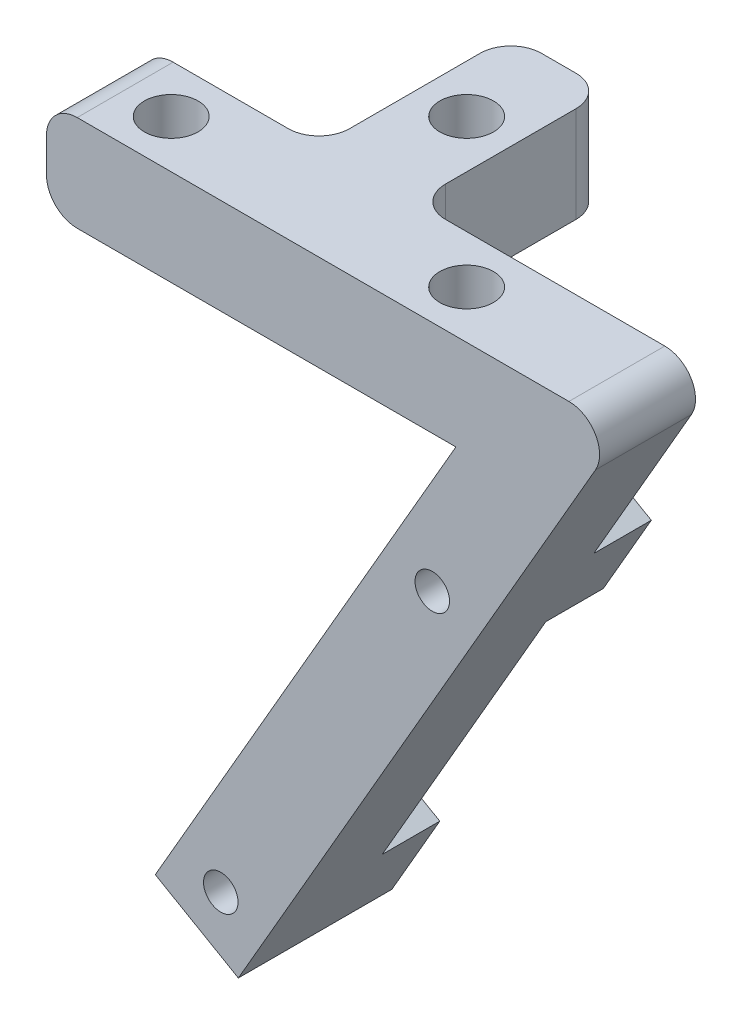
ISO-10303-21;
HEADER;
FILE_DESCRIPTION(('STEP AP214'),'2;1');
FILE_NAME('part.step','',(''),(''),'','','');
FILE_SCHEMA(('AUTOMOTIVE_DESIGN { 1 0 10303 214 1 1 1 1 }'));
ENDSEC;
DATA;
#1=APPLICATION_CONTEXT('core data for automotive mechanical design processes');
#2=APPLICATION_PROTOCOL_DEFINITION('international standard','automotive_design',2000,#1);
#3=PRODUCT_CONTEXT('',#1,'mechanical');
#4=PRODUCT('Part','Part','',(#3));
#5=PRODUCT_RELATED_PRODUCT_CATEGORY('part','',(#4));
#6=PRODUCT_DEFINITION_FORMATION('','',#4);
#7=PRODUCT_DEFINITION_CONTEXT('part definition',#1,'design');
#8=PRODUCT_DEFINITION('design','',#6,#7);
#9=PRODUCT_DEFINITION_SHAPE('','',#8);
#10=(LENGTH_UNIT() NAMED_UNIT(*) SI_UNIT(.MILLI.,.METRE.));
#11=(NAMED_UNIT(*) PLANE_ANGLE_UNIT() SI_UNIT($,.RADIAN.));
#12=(NAMED_UNIT(*) SI_UNIT($,.STERADIAN.) SOLID_ANGLE_UNIT());
#13=UNCERTAINTY_MEASURE_WITH_UNIT(LENGTH_MEASURE(1.E-05),#10,'distance_accuracy_value','');
#14=(GEOMETRIC_REPRESENTATION_CONTEXT(3) GLOBAL_UNCERTAINTY_ASSIGNED_CONTEXT((#13)) GLOBAL_UNIT_ASSIGNED_CONTEXT((#10,
#11,#12)) REPRESENTATION_CONTEXT('',''));
#15=CARTESIAN_POINT('',(0.,0.,0.));
#16=DIRECTION('',(0.,0.,1.));
#17=DIRECTION('',(1.,0.,0.));
#18=AXIS2_PLACEMENT_3D('',#15,#16,#17);
#19=CARTESIAN_POINT('',(0.,0.,0.));
#20=DIRECTION('',(0.,0.,-1.));
#21=DIRECTION('',(-1.,0.,0.));
#22=AXIS2_PLACEMENT_3D('',#19,#20,#21);
#23=PLANE('',#22);
#24=DIRECTION('',(0.500000000000004,0.866025403784436,0.));
#25=VECTOR('',#24,1.);
#26=CARTESIAN_POINT('',(38.1,0.,0.));
#27=LINE('',#26,#25);
#28=CARTESIAN_POINT('',(15.8749999999998,-38.4948291982182,0.));
#29=VERTEX_POINT('',#28);
#30=CARTESIAN_POINT('',(26.6999719999998,-19.7454277037077,0.));
#31=VERTEX_POINT('',#30);
#32=EDGE_CURVE('E314',#29,#31,#27,.T.);
#33=ORIENTED_EDGE('',*,*,#32,.F.);
#34=DIRECTION('',(0.866025403784438,-0.500000000000001,0.));
#35=VECTOR('',#34,1.);
#36=CARTESIAN_POINT('',(15.8749999999998,-38.4948291982182,0.));
#37=LINE('',#36,#35);
#38=CARTESIAN_POINT('',(10.3757386859688,-35.3198291982183,0.));
#39=VERTEX_POINT('',#38);
#40=EDGE_CURVE('E215',#39,#29,#37,.T.);
#41=ORIENTED_EDGE('',*,*,#40,.F.);
#42=DIRECTION('',(-0.500000000000004,-0.866025403784436,0.));
#43=VECTOR('',#42,1.);
#44=CARTESIAN_POINT('',(7.20073868596865,-40.8190905122493,0.));
#45=LINE('',#44,#43);
#46=CARTESIAN_POINT('',(21.2007106859688,-16.5704277037078,0.));
#47=VERTEX_POINT('',#46);
#48=EDGE_CURVE('E313',#47,#39,#45,.T.);
#49=ORIENTED_EDGE('',*,*,#48,.F.);
#50=DIRECTION('',(-0.866025403784438,0.500000000000001,0.));
#51=VECTOR('',#50,1.);
#52=CARTESIAN_POINT('',(21.2007106859688,-16.5704277037078,0.));
#53=LINE('',#52,#51);
#54=EDGE_CURVE('E226',#31,#47,#53,.T.);
#55=ORIENTED_EDGE('',*,*,#54,.F.);
#56=EDGE_LOOP('',(#33,#41,#49,#55));
#57=FACE_BOUND('',#56,.T.);
#58=ADVANCED_FACE('F33',(#57),#23,.T.);
#59=DIRECTION('',(1.,0.,0.));
#60=VECTOR('',#59,1.);
#61=CARTESIAN_POINT('',(27.1014773719376,-6.34999999999999,0.));
#62=LINE('',#61,#60);
#63=CARTESIAN_POINT('',(20.066,-6.35,0.));
#64=VERTEX_POINT('',#63);
#65=CARTESIAN_POINT('',(27.1014773719376,-6.34999999999999,0.));
#66=VERTEX_POINT('',#65);
#67=EDGE_CURVE('E306',#64,#66,#62,.T.);
#68=ORIENTED_EDGE('',*,*,#67,.F.);
#69=DIRECTION('',(0.,1.,0.));
#70=VECTOR('',#69,1.);
#71=CARTESIAN_POINT('',(20.066,0.,0.));
#72=LINE('',#71,#70);
#73=CARTESIAN_POINT('',(20.066,0.,0.));
#74=VERTEX_POINT('',#73);
#75=EDGE_CURVE('E356',#64,#74,#72,.T.);
#76=ORIENTED_EDGE('',*,*,#75,.T.);
#77=DIRECTION('',(-1.,0.,0.));
#78=VECTOR('',#77,1.);
#79=CARTESIAN_POINT('',(0.,0.,0.));
#80=LINE('',#79,#78);
#81=CARTESIAN_POINT('',(34.58047275902,0.,0.));
#82=VERTEX_POINT('',#81);
#83=EDGE_CURVE('E296',#82,#74,#80,.T.);
#84=ORIENTED_EDGE('',*,*,#83,.F.);
#85=CARTESIAN_POINT('',(34.58047275902,-2.032,0.));
#86=DIRECTION('',(0.,0.,-1.));
#87=DIRECTION('',(-1.,0.,0.));
#88=AXIS2_PLACEMENT_3D('',#85,#86,#87);
#89=CIRCLE('',#88,2.032);
#90=CARTESIAN_POINT('',(36.34023637951,-3.04800000000001,0.));
#91=VERTEX_POINT('',#90);
#92=EDGE_CURVE('E354',#82,#91,#89,.T.);
#93=ORIENTED_EDGE('',*,*,#92,.T.);
#94=CARTESIAN_POINT('',(29.8749719999998,-14.2461663896768,0.));
#95=VERTEX_POINT('',#94);
#96=EDGE_CURVE('E312',#95,#91,#27,.T.);
#97=ORIENTED_EDGE('',*,*,#96,.F.);
#98=DIRECTION('',(0.866025403784439,-0.5,0.));
#99=VECTOR('',#98,1.);
#100=CARTESIAN_POINT('',(29.8749719999998,-14.2461663896765,0.));
#101=LINE('',#100,#99);
#102=CARTESIAN_POINT('',(24.3757106859688,-11.0711663896766,0.));
#103=VERTEX_POINT('',#102);
#104=EDGE_CURVE('E231',#103,#95,#101,.T.);
#105=ORIENTED_EDGE('',*,*,#104,.F.);
#106=EDGE_CURVE('E309',#66,#103,#45,.T.);
#107=ORIENTED_EDGE('',*,*,#106,.F.);
#108=EDGE_LOOP('',(#68,#76,#84,#93,#97,#105,#107));
#109=FACE_BOUND('',#108,.T.);
#110=ADVANCED_FACE('F407',(#109),#23,.T.);
#111=CARTESIAN_POINT('',(0.,-6.35,6.35));
#112=DIRECTION('',(1.,0.,0.));
#113=DIRECTION('',(0.,0.,-1.));
#114=AXIS2_PLACEMENT_3D('',#111,#112,#113);
#115=PLANE('',#114);
#116=DIRECTION('',(0.,-1.,0.));
#117=VECTOR('',#116,1.);
#118=CARTESIAN_POINT('',(0.,-6.35,6.35));
#119=LINE('',#118,#117);
#120=CARTESIAN_POINT('',(0.,-2.032,6.35));
#121=VERTEX_POINT('',#120);
#122=CARTESIAN_POINT('',(0.,-4.318,6.35));
#123=VERTEX_POINT('',#122);
#124=EDGE_CURVE('E293',#121,#123,#119,.T.);
#125=ORIENTED_EDGE('',*,*,#124,.F.);
#126=DIRECTION('',(0.,0.,-1.));
#127=VECTOR('',#126,1.);
#128=CARTESIAN_POINT('',(0.,-2.032,6.35));
#129=LINE('',#128,#127);
#130=CARTESIAN_POINT('',(0.,-2.032,0.));
#131=VERTEX_POINT('',#130);
#132=EDGE_CURVE('E366',#121,#131,#129,.T.);
#133=ORIENTED_EDGE('',*,*,#132,.T.);
#134=DIRECTION('',(0.,-1.,0.));
#135=VECTOR('',#134,1.);
#136=CARTESIAN_POINT('',(0.,-6.35,0.));
#137=LINE('',#136,#135);
#138=CARTESIAN_POINT('',(0.,-4.318,0.));
#139=VERTEX_POINT('',#138);
#140=EDGE_CURVE('E284',#131,#139,#137,.T.);
#141=ORIENTED_EDGE('',*,*,#140,.T.);
#142=DIRECTION('',(0.,0.,-1.));
#143=VECTOR('',#142,1.);
#144=CARTESIAN_POINT('',(0.,-4.318,6.35));
#145=LINE('',#144,#143);
#146=EDGE_CURVE('E58',#139,#123,#145,.F.);
#147=ORIENTED_EDGE('',*,*,#146,.T.);
#148=EDGE_LOOP('',(#125,#133,#141,#147));
#149=FACE_BOUND('',#148,.T.);
#150=ADVANCED_FACE('F414',(#149),#115,.F.);
#151=CARTESIAN_POINT('',(27.1014773719376,-6.34999999999999,6.35));
#152=DIRECTION('',(0.,1.,0.));
#153=DIRECTION('',(-1.,0.,0.));
#154=AXIS2_PLACEMENT_3D('',#151,#152,#153);
#155=PLANE('',#154);
#156=CARTESIAN_POINT('',(14.859,-6.35,-6.604));
#157=DIRECTION('',(0.,1.,0.));
#158=DIRECTION('',(0.,0.,1.));
#159=AXIS2_PLACEMENT_3D('',#156,#157,#158);
#160=CIRCLE('',#159,1.778);
#161=CARTESIAN_POINT('',(14.859,-6.35,-4.826));
#162=VERTEX_POINT('',#161);
#163=EDGE_CURVE('E257',#162,#162,#160,.T.);
#164=ORIENTED_EDGE('',*,*,#163,.T.);
#165=EDGE_LOOP('',(#164));
#166=FACE_BOUND('',#165,.T.);
#167=CARTESIAN_POINT('',(5.08,-6.35,3.175));
#168=DIRECTION('',(0.,1.,0.));
#169=DIRECTION('',(0.,0.,1.));
#170=AXIS2_PLACEMENT_3D('',#167,#168,#169);
#171=CIRCLE('',#170,1.778);
#172=CARTESIAN_POINT('',(5.08,-6.35,4.953));
#173=VERTEX_POINT('',#172);
#174=EDGE_CURVE('E281',#173,#173,#171,.T.);
#175=ORIENTED_EDGE('',*,*,#174,.T.);
#176=EDGE_LOOP('',(#175));
#177=FACE_BOUND('',#176,.T.);
#178=CARTESIAN_POINT('',(24.638,-6.35,3.175));
#179=DIRECTION('',(0.,1.,0.));
#180=DIRECTION('',(0.,0.,1.));
#181=AXIS2_PLACEMENT_3D('',#178,#179,#180);
#182=CIRCLE('',#181,1.778);
#183=CARTESIAN_POINT('',(24.638,-6.35,4.953));
#184=VERTEX_POINT('',#183);
#185=EDGE_CURVE('E288',#184,#184,#182,.T.);
#186=ORIENTED_EDGE('',*,*,#185,.T.);
#187=EDGE_LOOP('',(#186));
#188=FACE_BOUND('',#187,.T.);
#189=DIRECTION('',(0.,0.,1.));
#190=VECTOR('',#189,1.);
#191=CARTESIAN_POINT('',(11.684,-6.35,0.));
#192=LINE('',#191,#190);
#193=CARTESIAN_POINT('',(11.684,-6.35,-10.668));
#194=VERTEX_POINT('',#193);
#195=CARTESIAN_POINT('',(11.684,-6.35,-2.032));
#196=VERTEX_POINT('',#195);
#197=EDGE_CURVE('E263',#194,#196,#192,.T.);
#198=ORIENTED_EDGE('',*,*,#197,.F.);
#199=CARTESIAN_POINT('',(13.716,-6.35,-10.668));
#200=DIRECTION('',(0.,1.,0.));
#201=DIRECTION('',(-1.,0.,0.));
#202=AXIS2_PLACEMENT_3D('',#199,#200,#201);
#203=CIRCLE('',#202,2.032);
#204=CARTESIAN_POINT('',(13.716,-6.35,-12.7));
#205=VERTEX_POINT('',#204);
#206=EDGE_CURVE('E347',#194,#205,#203,.F.);
#207=ORIENTED_EDGE('',*,*,#206,.T.);
#208=DIRECTION('',(-1.,0.,0.));
#209=VECTOR('',#208,1.);
#210=CARTESIAN_POINT('',(11.684,-6.35,-12.7));
#211=LINE('',#210,#209);
#212=CARTESIAN_POINT('',(16.002,-6.35,-12.7));
#213=VERTEX_POINT('',#212);
#214=EDGE_CURVE('E270',#213,#205,#211,.T.);
#215=ORIENTED_EDGE('',*,*,#214,.F.);
#216=CARTESIAN_POINT('',(16.002,-6.35,-10.668));
#217=DIRECTION('',(0.,1.,0.));
#218=DIRECTION('',(-1.,0.,0.));
#219=AXIS2_PLACEMENT_3D('',#216,#217,#218);
#220=CIRCLE('',#219,2.032);
#221=CARTESIAN_POINT('',(18.034,-6.35,-10.668));
#222=VERTEX_POINT('',#221);
#223=EDGE_CURVE('E345',#213,#222,#220,.F.);
#224=ORIENTED_EDGE('',*,*,#223,.T.);
#225=DIRECTION('',(0.,0.,-1.));
#226=VECTOR('',#225,1.);
#227=CARTESIAN_POINT('',(18.034,-6.35,0.));
#228=LINE('',#227,#226);
#229=CARTESIAN_POINT('',(18.034,-6.35,-2.032));
#230=VERTEX_POINT('',#229);
#231=EDGE_CURVE('E266',#230,#222,#228,.T.);
#232=ORIENTED_EDGE('',*,*,#231,.F.);
#233=CARTESIAN_POINT('',(20.066,-6.35,-2.032));
#234=DIRECTION('',(0.,1.,0.));
#235=DIRECTION('',(-1.,0.,0.));
#236=AXIS2_PLACEMENT_3D('',#233,#234,#235);
#237=CIRCLE('',#236,2.032);
#238=EDGE_CURVE('E378',#230,#64,#237,.T.);
#239=ORIENTED_EDGE('',*,*,#238,.T.);
#240=ORIENTED_EDGE('',*,*,#67,.T.);
#241=DIRECTION('',(0.,0.,-1.));
#242=VECTOR('',#241,1.);
#243=CARTESIAN_POINT('',(27.1014773719376,-6.34999999999999,6.35));
#244=LINE('',#243,#242);
#245=CARTESIAN_POINT('',(27.1014773719376,-6.34999999999999,6.35));
#246=VERTEX_POINT('',#245);
#247=EDGE_CURVE('E320',#246,#66,#244,.T.);
#248=ORIENTED_EDGE('',*,*,#247,.F.);
#249=DIRECTION('',(1.,0.,0.));
#250=VECTOR('',#249,1.);
#251=CARTESIAN_POINT('',(27.1014773719376,-6.34999999999999,6.35));
#252=LINE('',#251,#250);
#253=CARTESIAN_POINT('',(2.032,-6.35,6.35));
#254=VERTEX_POINT('',#253);
#255=EDGE_CURVE('E295',#254,#246,#252,.T.);
#256=ORIENTED_EDGE('',*,*,#255,.F.);
#257=DIRECTION('',(0.,0.,-1.));
#258=VECTOR('',#257,1.);
#259=CARTESIAN_POINT('',(2.032,-6.35,6.35));
#260=LINE('',#259,#258);
#261=CARTESIAN_POINT('',(2.032,-6.35,0.));
#262=VERTEX_POINT('',#261);
#263=EDGE_CURVE('E342',#254,#262,#260,.T.);
#264=ORIENTED_EDGE('',*,*,#263,.T.);
#265=CARTESIAN_POINT('',(9.652,-6.35,0.));
#266=VERTEX_POINT('',#265);
#267=EDGE_CURVE('E308',#262,#266,#62,.T.);
#268=ORIENTED_EDGE('',*,*,#267,.T.);
#269=CARTESIAN_POINT('',(9.652,-6.35,-2.032));
#270=DIRECTION('',(0.,1.,0.));
#271=DIRECTION('',(-1.,0.,0.));
#272=AXIS2_PLACEMENT_3D('',#269,#270,#271);
#273=CIRCLE('',#272,2.032);
#274=EDGE_CURVE('E11',#266,#196,#273,.T.);
#275=ORIENTED_EDGE('',*,*,#274,.T.);
#276=EDGE_LOOP('',(#198,#207,#215,#224,#232,#239,#240,#248,#256,#264,#268,#275));
#277=FACE_BOUND('',#276,.T.);
#278=ADVANCED_FACE('F445',(#166,#177,#188,#277),#155,.F.);
#279=CARTESIAN_POINT('',(7.20073868596865,-40.8190905122493,6.35));
#280=DIRECTION('',(0.866025403784436,-0.500000000000004,0.));
#281=DIRECTION('',(0.500000000000004,0.866025403784436,0.));
#282=AXIS2_PLACEMENT_3D('',#279,#280,#281);
#283=PLANE('',#282);
#284=ORIENTED_EDGE('',*,*,#106,.T.);
#285=DIRECTION('',(0.,0.,1.));
#286=VECTOR('',#285,1.);
#287=CARTESIAN_POINT('',(24.3757106859688,-11.0711663896766,-3.81));
#288=LINE('',#287,#286);
#289=CARTESIAN_POINT('',(24.3757106859688,-11.0711663896766,-3.81));
#290=VERTEX_POINT('',#289);
#291=EDGE_CURVE('E242',#290,#103,#288,.T.);
#292=ORIENTED_EDGE('',*,*,#291,.F.);
#293=DIRECTION('',(0.500000000000001,0.866025403784438,0.));
#294=VECTOR('',#293,1.);
#295=CARTESIAN_POINT('',(24.3757106859688,-11.0711663896766,-3.81));
#296=LINE('',#295,#294);
#297=CARTESIAN_POINT('',(21.2007106859688,-16.5704277037078,-3.81));
#298=VERTEX_POINT('',#297);
#299=EDGE_CURVE('E233',#298,#290,#296,.T.);
#300=ORIENTED_EDGE('',*,*,#299,.F.);
#301=DIRECTION('',(0.,0.,1.));
#302=VECTOR('',#301,1.);
#303=CARTESIAN_POINT('',(21.2007106859688,-16.5704277037078,-3.81));
#304=LINE('',#303,#302);
#305=EDGE_CURVE('E244',#298,#47,#304,.T.);
#306=ORIENTED_EDGE('',*,*,#305,.T.);
#307=ORIENTED_EDGE('',*,*,#48,.T.);
#308=DIRECTION('',(0.,0.,1.));
#309=VECTOR('',#308,1.);
#310=CARTESIAN_POINT('',(10.3757386859688,-35.3198291982183,-3.81));
#311=LINE('',#310,#309);
#312=CARTESIAN_POINT('',(10.3757386859688,-35.3198291982183,-3.81));
#313=VERTEX_POINT('',#312);
#314=EDGE_CURVE('E224',#313,#39,#311,.T.);
#315=ORIENTED_EDGE('',*,*,#314,.F.);
#316=DIRECTION('',(0.500000000000025,0.866025403784425,0.));
#317=VECTOR('',#316,1.);
#318=CARTESIAN_POINT('',(10.3757386859688,-35.3198291982183,-3.81));
#319=LINE('',#318,#317);
#320=CARTESIAN_POINT('',(7.20073868596865,-40.8190905122493,-3.81));
#321=VERTEX_POINT('',#320);
#322=EDGE_CURVE('E209',#321,#313,#319,.T.);
#323=ORIENTED_EDGE('',*,*,#322,.F.);
#324=DIRECTION('',(0.,0.,-1.));
#325=VECTOR('',#324,1.);
#326=CARTESIAN_POINT('',(7.20073868596865,-40.8190905122493,6.35));
#327=LINE('',#326,#325);
#328=CARTESIAN_POINT('',(7.20073868596865,-40.8190905122493,6.35));
#329=VERTEX_POINT('',#328);
#330=EDGE_CURVE('E200',#329,#321,#327,.T.);
#331=ORIENTED_EDGE('',*,*,#330,.F.);
#332=DIRECTION('',(-0.500000000000004,-0.866025403784436,0.));
#333=VECTOR('',#332,1.);
#334=CARTESIAN_POINT('',(7.20073868596865,-40.8190905122493,6.35));
#335=LINE('',#334,#333);
#336=EDGE_CURVE('E298',#246,#329,#335,.T.);
#337=ORIENTED_EDGE('',*,*,#336,.F.);
#338=ORIENTED_EDGE('',*,*,#247,.T.);
#339=EDGE_LOOP('',(#284,#292,#300,#306,#307,#315,#323,#331,#337,#338));
#340=FACE_BOUND('',#339,.T.);
#341=ADVANCED_FACE('F480',(#340),#283,.F.);
#342=CARTESIAN_POINT('',(12.6999999999998,-43.9940905122494,6.35));
#343=DIRECTION('',(0.500000000000004,0.866025403784436,0.));
#344=DIRECTION('',(-0.866025403784436,0.500000000000004,0.));
#345=AXIS2_PLACEMENT_3D('',#342,#343,#344);
#346=PLANE('',#345);
#347=ORIENTED_EDGE('',*,*,#330,.T.);
#348=DIRECTION('',(-0.866025403784436,0.500000000000004,0.));
#349=VECTOR('',#348,1.);
#350=CARTESIAN_POINT('',(7.20073868596865,-40.8190905122493,-3.81));
#351=LINE('',#350,#349);
#352=CARTESIAN_POINT('',(12.6999999999998,-43.9940905122494,-3.81));
#353=VERTEX_POINT('',#352);
#354=EDGE_CURVE('E204',#353,#321,#351,.T.);
#355=ORIENTED_EDGE('',*,*,#354,.F.);
#356=DIRECTION('',(0.,0.,-1.));
#357=VECTOR('',#356,1.);
#358=CARTESIAN_POINT('',(12.6999999999998,-43.9940905122494,6.35));
#359=LINE('',#358,#357);
#360=CARTESIAN_POINT('',(12.6999999999998,-43.9940905122494,6.35));
#361=VERTEX_POINT('',#360);
#362=EDGE_CURVE('E192',#361,#353,#359,.T.);
#363=ORIENTED_EDGE('',*,*,#362,.F.);
#364=DIRECTION('',(0.866025403784436,-0.500000000000004,0.));
#365=VECTOR('',#364,1.);
#366=CARTESIAN_POINT('',(12.6999999999998,-43.9940905122494,6.35));
#367=LINE('',#366,#365);
#368=EDGE_CURVE('E300',#329,#361,#367,.T.);
#369=ORIENTED_EDGE('',*,*,#368,.F.);
#370=EDGE_LOOP('',(#347,#355,#363,#369));
#371=FACE_BOUND('',#370,.T.);
#372=ADVANCED_FACE('F205',(#371),#346,.F.);
#373=CARTESIAN_POINT('',(38.1,0.,6.35));
#374=DIRECTION('',(-0.866025403784436,0.500000000000004,0.));
#375=DIRECTION('',(-0.500000000000004,-0.866025403784437,0.));
#376=AXIS2_PLACEMENT_3D('',#373,#374,#375);
#377=PLANE('',#376);
#378=ORIENTED_EDGE('',*,*,#96,.T.);
#379=DIRECTION('',(0.,0.,-1.));
#380=VECTOR('',#379,1.);
#381=CARTESIAN_POINT('',(36.34023637951,-3.04800000000001,6.35));
#382=LINE('',#381,#380);
#383=CARTESIAN_POINT('',(36.34023637951,-3.04800000000001,6.35));
#384=VERTEX_POINT('',#383);
#385=EDGE_CURVE('E50',#91,#384,#382,.F.);
#386=ORIENTED_EDGE('',*,*,#385,.T.);
#387=DIRECTION('',(0.500000000000004,0.866025403784436,0.));
#388=VECTOR('',#387,1.);
#389=CARTESIAN_POINT('',(38.1,0.,6.35));
#390=LINE('',#389,#388);
#391=EDGE_CURVE('E197',#361,#384,#390,.T.);
#392=ORIENTED_EDGE('',*,*,#391,.F.);
#393=ORIENTED_EDGE('',*,*,#362,.T.);
#394=DIRECTION('',(-0.5,-0.866025403784438,0.));
#395=VECTOR('',#394,1.);
#396=CARTESIAN_POINT('',(12.6999999999998,-43.9940905122494,-3.81));
#397=LINE('',#396,#395);
#398=CARTESIAN_POINT('',(15.8749999999998,-38.4948291982182,-3.81));
#399=VERTEX_POINT('',#398);
#400=EDGE_CURVE('E196',#399,#353,#397,.T.);
#401=ORIENTED_EDGE('',*,*,#400,.F.);
#402=DIRECTION('',(0.,0.,1.));
#403=VECTOR('',#402,1.);
#404=CARTESIAN_POINT('',(15.8749999999998,-38.4948291982182,-3.81));
#405=LINE('',#404,#403);
#406=EDGE_CURVE('E221',#399,#29,#405,.T.);
#407=ORIENTED_EDGE('',*,*,#406,.T.);
#408=ORIENTED_EDGE('',*,*,#32,.T.);
#409=DIRECTION('',(0.,0.,1.));
#410=VECTOR('',#409,1.);
#411=CARTESIAN_POINT('',(26.6999719999998,-19.7454277037077,-3.81));
#412=LINE('',#411,#410);
#413=CARTESIAN_POINT('',(26.6999719999998,-19.7454277037077,-3.81));
#414=VERTEX_POINT('',#413);
#415=EDGE_CURVE('E247',#414,#31,#412,.T.);
#416=ORIENTED_EDGE('',*,*,#415,.F.);
#417=DIRECTION('',(-0.5,-0.866025403784439,0.));
#418=VECTOR('',#417,1.);
#419=CARTESIAN_POINT('',(26.6999719999998,-19.7454277037077,-3.81));
#420=LINE('',#419,#418);
#421=CARTESIAN_POINT('',(29.8749719999998,-14.2461663896765,-3.81));
#422=VERTEX_POINT('',#421);
#423=EDGE_CURVE('E227',#422,#414,#420,.T.);
#424=ORIENTED_EDGE('',*,*,#423,.F.);
#425=DIRECTION('',(0.,0.,1.));
#426=VECTOR('',#425,1.);
#427=CARTESIAN_POINT('',(29.8749719999998,-14.2461663896765,-3.81));
#428=LINE('',#427,#426);
#429=EDGE_CURVE('E237',#422,#95,#428,.T.);
#430=ORIENTED_EDGE('',*,*,#429,.T.);
#431=EDGE_LOOP('',(#378,#386,#392,#393,#401,#407,#408,#416,#424,#430));
#432=FACE_BOUND('',#431,.T.);
#433=ADVANCED_FACE('F194',(#432),#377,.F.);
#434=CARTESIAN_POINT('',(0.,0.,6.35));
#435=DIRECTION('',(0.,-1.,0.));
#436=DIRECTION('',(0.,0.,-1.));
#437=AXIS2_PLACEMENT_3D('',#434,#435,#436);
#438=PLANE('',#437);
#439=CARTESIAN_POINT('',(14.859,0.,-6.604));
#440=DIRECTION('',(0.,1.,0.));
#441=DIRECTION('',(0.,0.,1.));
#442=AXIS2_PLACEMENT_3D('',#439,#440,#441);
#443=CIRCLE('',#442,1.778);
#444=CARTESIAN_POINT('',(14.859,0.,-4.826));
#445=VERTEX_POINT('',#444);
#446=EDGE_CURVE('E254',#445,#445,#443,.T.);
#447=ORIENTED_EDGE('',*,*,#446,.F.);
#448=EDGE_LOOP('',(#447));
#449=FACE_BOUND('',#448,.T.);
#450=CARTESIAN_POINT('',(5.08,0.,3.175));
#451=DIRECTION('',(0.,1.,0.));
#452=DIRECTION('',(0.,0.,1.));
#453=AXIS2_PLACEMENT_3D('',#450,#451,#452);
#454=CIRCLE('',#453,1.778);
#455=CARTESIAN_POINT('',(5.08,0.,4.953));
#456=VERTEX_POINT('',#455);
#457=EDGE_CURVE('E285',#456,#456,#454,.T.);
#458=ORIENTED_EDGE('',*,*,#457,.F.);
#459=EDGE_LOOP('',(#458));
#460=FACE_BOUND('',#459,.T.);
#461=CARTESIAN_POINT('',(24.638,0.,3.175));
#462=DIRECTION('',(0.,1.,0.));
#463=DIRECTION('',(0.,0.,1.));
#464=AXIS2_PLACEMENT_3D('',#461,#462,#463);
#465=CIRCLE('',#464,1.778);
#466=CARTESIAN_POINT('',(24.638,0.,4.953));
#467=VERTEX_POINT('',#466);
#468=EDGE_CURVE('E273',#467,#467,#465,.T.);
#469=ORIENTED_EDGE('',*,*,#468,.F.);
#470=EDGE_LOOP('',(#469));
#471=FACE_BOUND('',#470,.T.);
#472=DIRECTION('',(-1.,0.,0.));
#473=VECTOR('',#472,1.);
#474=CARTESIAN_POINT('',(11.684,0.,-12.7));
#475=LINE('',#474,#473);
#476=CARTESIAN_POINT('',(16.002,0.,-12.7));
#477=VERTEX_POINT('',#476);
#478=CARTESIAN_POINT('',(13.716,0.,-12.7));
#479=VERTEX_POINT('',#478);
#480=EDGE_CURVE('E267',#477,#479,#475,.T.);
#481=ORIENTED_EDGE('',*,*,#480,.T.);
#482=CARTESIAN_POINT('',(13.716,0.,-10.668));
#483=DIRECTION('',(0.,-1.,0.));
#484=DIRECTION('',(0.,0.,-1.));
#485=AXIS2_PLACEMENT_3D('',#482,#483,#484);
#486=CIRCLE('',#485,2.032);
#487=CARTESIAN_POINT('',(11.684,0.,-10.668));
#488=VERTEX_POINT('',#487);
#489=EDGE_CURVE('E335',#479,#488,#486,.F.);
#490=ORIENTED_EDGE('',*,*,#489,.T.);
#491=DIRECTION('',(0.,0.,1.));
#492=VECTOR('',#491,1.);
#493=CARTESIAN_POINT('',(11.684,0.,0.));
#494=LINE('',#493,#492);
#495=CARTESIAN_POINT('',(11.684,0.,-2.032));
#496=VERTEX_POINT('',#495);
#497=EDGE_CURVE('E260',#488,#496,#494,.T.);
#498=ORIENTED_EDGE('',*,*,#497,.T.);
#499=CARTESIAN_POINT('',(9.652,0.,-2.032));
#500=DIRECTION('',(0.,-1.,0.));
#501=DIRECTION('',(0.,0.,-1.));
#502=AXIS2_PLACEMENT_3D('',#499,#500,#501);
#503=CIRCLE('',#502,2.032);
#504=CARTESIAN_POINT('',(9.652,0.,0.));
#505=VERTEX_POINT('',#504);
#506=EDGE_CURVE('E42',#496,#505,#503,.T.);
#507=ORIENTED_EDGE('',*,*,#506,.T.);
#508=CARTESIAN_POINT('',(2.032,0.,0.));
#509=VERTEX_POINT('',#508);
#510=EDGE_CURVE('E316',#505,#509,#80,.T.);
#511=ORIENTED_EDGE('',*,*,#510,.T.);
#512=DIRECTION('',(0.,0.,-1.));
#513=VECTOR('',#512,1.);
#514=CARTESIAN_POINT('',(2.032,0.,6.35));
#515=LINE('',#514,#513);
#516=CARTESIAN_POINT('',(2.032,0.,6.35));
#517=VERTEX_POINT('',#516);
#518=EDGE_CURVE('E331',#509,#517,#515,.F.);
#519=ORIENTED_EDGE('',*,*,#518,.T.);
#520=DIRECTION('',(-1.,0.,0.));
#521=VECTOR('',#520,1.);
#522=CARTESIAN_POINT('',(0.,0.,6.35));
#523=LINE('',#522,#521);
#524=CARTESIAN_POINT('',(34.58047275902,0.,6.35));
#525=VERTEX_POINT('',#524);
#526=EDGE_CURVE('E201',#525,#517,#523,.T.);
#527=ORIENTED_EDGE('',*,*,#526,.F.);
#528=DIRECTION('',(0.,0.,-1.));
#529=VECTOR('',#528,1.);
#530=CARTESIAN_POINT('',(34.58047275902,0.,6.35));
#531=LINE('',#530,#529);
#532=EDGE_CURVE('E328',#525,#82,#531,.T.);
#533=ORIENTED_EDGE('',*,*,#532,.T.);
#534=ORIENTED_EDGE('',*,*,#83,.T.);
#535=CARTESIAN_POINT('',(20.066,0.,-2.032));
#536=DIRECTION('',(0.,-1.,0.));
#537=DIRECTION('',(0.,0.,-1.));
#538=AXIS2_PLACEMENT_3D('',#535,#536,#537);
#539=CIRCLE('',#538,2.032);
#540=CARTESIAN_POINT('',(18.034,0.,-2.032));
#541=VERTEX_POINT('',#540);
#542=EDGE_CURVE('E376',#74,#541,#539,.T.);
#543=ORIENTED_EDGE('',*,*,#542,.T.);
#544=DIRECTION('',(0.,0.,-1.));
#545=VECTOR('',#544,1.);
#546=CARTESIAN_POINT('',(18.034,0.,0.));
#547=LINE('',#546,#545);
#548=CARTESIAN_POINT('',(18.034,0.,-10.668));
#549=VERTEX_POINT('',#548);
#550=EDGE_CURVE('E276',#541,#549,#547,.T.);
#551=ORIENTED_EDGE('',*,*,#550,.T.);
#552=CARTESIAN_POINT('',(16.002,0.,-10.668));
#553=DIRECTION('',(0.,-1.,0.));
#554=DIRECTION('',(0.,0.,-1.));
#555=AXIS2_PLACEMENT_3D('',#552,#553,#554);
#556=CIRCLE('',#555,2.032);
#557=EDGE_CURVE('E333',#549,#477,#556,.F.);
#558=ORIENTED_EDGE('',*,*,#557,.T.);
#559=EDGE_LOOP('',(#481,#490,#498,#507,#511,#519,#527,#533,#534,#543,#551,#558));
#560=FACE_BOUND('',#559,.T.);
#561=ADVANCED_FACE('F430',(#449,#460,#471,#560),#438,.F.);
#562=CARTESIAN_POINT('',(0.,0.,6.35));
#563=DIRECTION('',(0.,0.,-1.));
#564=DIRECTION('',(-1.,0.,0.));
#565=AXIS2_PLACEMENT_3D('',#562,#563,#564);
#566=PLANE('',#565);
#567=CARTESIAN_POINT('',(11.5378693429842,-39.6569598552338,6.35));
#568=DIRECTION('',(0.,0.,1.));
#569=DIRECTION('',(1.,0.,0.));
#570=AXIS2_PLACEMENT_3D('',#567,#568,#569);
#571=CIRCLE('',#570,1.143);
#572=CARTESIAN_POINT('',(12.6808693429842,-39.6569598552338,6.35));
#573=VERTEX_POINT('',#572);
#574=EDGE_CURVE('E251',#573,#573,#571,.T.);
#575=ORIENTED_EDGE('',*,*,#574,.F.);
#576=EDGE_LOOP('',(#575));
#577=FACE_BOUND('',#576,.T.);
#578=CARTESIAN_POINT('',(25.5378413429842,-15.4082970466921,6.35));
#579=DIRECTION('',(0.,0.,1.));
#580=DIRECTION('',(1.,0.,0.));
#581=AXIS2_PLACEMENT_3D('',#578,#579,#580);
#582=CIRCLE('',#581,1.143);
#583=CARTESIAN_POINT('',(26.6808413429842,-15.4082970466921,6.35));
#584=VERTEX_POINT('',#583);
#585=EDGE_CURVE('E250',#584,#584,#582,.T.);
#586=ORIENTED_EDGE('',*,*,#585,.F.);
#587=EDGE_LOOP('',(#586));
#588=FACE_BOUND('',#587,.T.);
#589=ORIENTED_EDGE('',*,*,#526,.T.);
#590=CARTESIAN_POINT('',(2.032,-2.032,6.35));
#591=DIRECTION('',(0.,0.,-1.));
#592=DIRECTION('',(-1.,0.,0.));
#593=AXIS2_PLACEMENT_3D('',#590,#591,#592);
#594=CIRCLE('',#593,2.032);
#595=EDGE_CURVE('E373',#517,#121,#594,.F.);
#596=ORIENTED_EDGE('',*,*,#595,.T.);
#597=ORIENTED_EDGE('',*,*,#124,.T.);
#598=CARTESIAN_POINT('',(2.032,-4.318,6.35));
#599=DIRECTION('',(0.,0.,-1.));
#600=DIRECTION('',(-1.,0.,0.));
#601=AXIS2_PLACEMENT_3D('',#598,#599,#600);
#602=CIRCLE('',#601,2.032);
#603=EDGE_CURVE('E371',#123,#254,#602,.F.);
#604=ORIENTED_EDGE('',*,*,#603,.T.);
#605=ORIENTED_EDGE('',*,*,#255,.T.);
#606=ORIENTED_EDGE('',*,*,#336,.T.);
#607=ORIENTED_EDGE('',*,*,#368,.T.);
#608=ORIENTED_EDGE('',*,*,#391,.T.);
#609=CARTESIAN_POINT('',(34.58047275902,-2.032,6.35));
#610=DIRECTION('',(0.,0.,-1.));
#611=DIRECTION('',(-1.,0.,0.));
#612=AXIS2_PLACEMENT_3D('',#609,#610,#611);
#613=CIRCLE('',#612,2.032);
#614=EDGE_CURVE('E369',#384,#525,#613,.F.);
#615=ORIENTED_EDGE('',*,*,#614,.T.);
#616=EDGE_LOOP('',(#589,#596,#597,#604,#605,#606,#607,#608,#615));
#617=FACE_BOUND('',#616,.T.);
#618=ADVANCED_FACE('F421',(#577,#588,#617),#566,.F.);
#619=ORIENTED_EDGE('',*,*,#510,.F.);
#620=DIRECTION('',(0.,1.,0.));
#621=VECTOR('',#620,1.);
#622=CARTESIAN_POINT('',(9.652,-6.35,0.));
#623=LINE('',#622,#621);
#624=EDGE_CURVE('E363',#505,#266,#623,.F.);
#625=ORIENTED_EDGE('',*,*,#624,.T.);
#626=ORIENTED_EDGE('',*,*,#267,.F.);
#627=CARTESIAN_POINT('',(2.032,-4.318,0.));
#628=DIRECTION('',(0.,0.,-1.));
#629=DIRECTION('',(-1.,0.,0.));
#630=AXIS2_PLACEMENT_3D('',#627,#628,#629);
#631=CIRCLE('',#630,2.032);
#632=EDGE_CURVE('E359',#262,#139,#631,.T.);
#633=ORIENTED_EDGE('',*,*,#632,.T.);
#634=ORIENTED_EDGE('',*,*,#140,.F.);
#635=CARTESIAN_POINT('',(2.032,-2.032,0.));
#636=DIRECTION('',(0.,0.,-1.));
#637=DIRECTION('',(-1.,0.,0.));
#638=AXIS2_PLACEMENT_3D('',#635,#636,#637);
#639=CIRCLE('',#638,2.032);
#640=EDGE_CURVE('E361',#131,#509,#639,.T.);
#641=ORIENTED_EDGE('',*,*,#640,.T.);
#642=EDGE_LOOP('',(#619,#625,#626,#633,#634,#641));
#643=FACE_BOUND('',#642,.T.);
#644=ADVANCED_FACE('F410',(#643),#23,.T.);
#645=CARTESIAN_POINT('',(24.638,-6.35,3.175));
#646=DIRECTION('',(0.,1.,0.));
#647=DIRECTION('',(0.,0.,1.));
#648=AXIS2_PLACEMENT_3D('',#645,#646,#647);
#649=CYLINDRICAL_SURFACE('',#648,1.778);
#650=ORIENTED_EDGE('',*,*,#185,.F.);
#651=EDGE_LOOP('',(#650));
#652=FACE_BOUND('',#651,.T.);
#653=ORIENTED_EDGE('',*,*,#468,.T.);
#654=EDGE_LOOP('',(#653));
#655=FACE_BOUND('',#654,.T.);
#656=ADVANCED_FACE('F420',(#652,#655),#649,.F.);
#657=CARTESIAN_POINT('',(5.08,-6.35,3.175));
#658=DIRECTION('',(0.,1.,0.));
#659=DIRECTION('',(0.,0.,1.));
#660=AXIS2_PLACEMENT_3D('',#657,#658,#659);
#661=CYLINDRICAL_SURFACE('',#660,1.778);
#662=ORIENTED_EDGE('',*,*,#174,.F.);
#663=EDGE_LOOP('',(#662));
#664=FACE_BOUND('',#663,.T.);
#665=ORIENTED_EDGE('',*,*,#457,.T.);
#666=EDGE_LOOP('',(#665));
#667=FACE_BOUND('',#666,.T.);
#668=ADVANCED_FACE('F427',(#664,#667),#661,.F.);
#669=CARTESIAN_POINT('',(11.684,-6.35,0.));
#670=DIRECTION('',(-1.,0.,0.));
#671=DIRECTION('',(0.,0.,1.));
#672=AXIS2_PLACEMENT_3D('',#669,#670,#671);
#673=PLANE('',#672);
#674=ORIENTED_EDGE('',*,*,#497,.F.);
#675=DIRECTION('',(0.,1.,0.));
#676=VECTOR('',#675,1.);
#677=CARTESIAN_POINT('',(11.684,-6.35,-10.668));
#678=LINE('',#677,#676);
#679=EDGE_CURVE('E340',#488,#194,#678,.F.);
#680=ORIENTED_EDGE('',*,*,#679,.T.);
#681=ORIENTED_EDGE('',*,*,#197,.T.);
#682=DIRECTION('',(0.,1.,0.));
#683=VECTOR('',#682,1.);
#684=CARTESIAN_POINT('',(11.684,0.,-2.032));
#685=LINE('',#684,#683);
#686=EDGE_CURVE('E337',#196,#496,#685,.T.);
#687=ORIENTED_EDGE('',*,*,#686,.T.);
#688=EDGE_LOOP('',(#674,#680,#681,#687));
#689=FACE_BOUND('',#688,.T.);
#690=ADVANCED_FACE('F449',(#689),#673,.T.);
#691=CARTESIAN_POINT('',(11.684,-6.35,-12.7));
#692=DIRECTION('',(0.,0.,-1.));
#693=DIRECTION('',(-1.,0.,0.));
#694=AXIS2_PLACEMENT_3D('',#691,#692,#693);
#695=PLANE('',#694);
#696=ORIENTED_EDGE('',*,*,#214,.T.);
#697=DIRECTION('',(0.,1.,0.));
#698=VECTOR('',#697,1.);
#699=CARTESIAN_POINT('',(13.716,-6.35,-12.7));
#700=LINE('',#699,#698);
#701=EDGE_CURVE('E325',#205,#479,#700,.T.);
#702=ORIENTED_EDGE('',*,*,#701,.T.);
#703=ORIENTED_EDGE('',*,*,#480,.F.);
#704=DIRECTION('',(0.,1.,0.));
#705=VECTOR('',#704,1.);
#706=CARTESIAN_POINT('',(16.002,-6.35,-12.7));
#707=LINE('',#706,#705);
#708=EDGE_CURVE('E323',#477,#213,#707,.F.);
#709=ORIENTED_EDGE('',*,*,#708,.T.);
#710=EDGE_LOOP('',(#696,#702,#703,#709));
#711=FACE_BOUND('',#710,.T.);
#712=ADVANCED_FACE('F457',(#711),#695,.T.);
#713=CARTESIAN_POINT('',(18.034,-6.35,0.));
#714=DIRECTION('',(1.,0.,0.));
#715=DIRECTION('',(0.,0.,-1.));
#716=AXIS2_PLACEMENT_3D('',#713,#714,#715);
#717=PLANE('',#716);
#718=ORIENTED_EDGE('',*,*,#231,.T.);
#719=DIRECTION('',(0.,1.,0.));
#720=VECTOR('',#719,1.);
#721=CARTESIAN_POINT('',(18.034,-6.35,-10.668));
#722=LINE('',#721,#720);
#723=EDGE_CURVE('E351',#222,#549,#722,.T.);
#724=ORIENTED_EDGE('',*,*,#723,.T.);
#725=ORIENTED_EDGE('',*,*,#550,.F.);
#726=DIRECTION('',(0.,1.,0.));
#727=VECTOR('',#726,1.);
#728=CARTESIAN_POINT('',(18.034,-6.35,-2.032));
#729=LINE('',#728,#727);
#730=EDGE_CURVE('E349',#541,#230,#729,.F.);
#731=ORIENTED_EDGE('',*,*,#730,.T.);
#732=EDGE_LOOP('',(#718,#724,#725,#731));
#733=FACE_BOUND('',#732,.T.);
#734=ADVANCED_FACE('F403',(#733),#717,.T.);
#735=CARTESIAN_POINT('',(14.859,-6.35,-6.604));
#736=DIRECTION('',(0.,1.,0.));
#737=DIRECTION('',(0.,0.,1.));
#738=AXIS2_PLACEMENT_3D('',#735,#736,#737);
#739=CYLINDRICAL_SURFACE('',#738,1.778);
#740=ORIENTED_EDGE('',*,*,#163,.F.);
#741=EDGE_LOOP('',(#740));
#742=FACE_BOUND('',#741,.T.);
#743=ORIENTED_EDGE('',*,*,#446,.T.);
#744=EDGE_LOOP('',(#743));
#745=FACE_BOUND('',#744,.T.);
#746=ADVANCED_FACE('F393',(#742,#745),#739,.F.);
#747=CARTESIAN_POINT('',(25.5378413429842,-15.4082970466921,-6.35));
#748=DIRECTION('',(0.,0.,1.));
#749=DIRECTION('',(1.,0.,0.));
#750=AXIS2_PLACEMENT_3D('',#747,#748,#749);
#751=CYLINDRICAL_SURFACE('',#750,1.143);
#752=ORIENTED_EDGE('',*,*,#585,.T.);
#753=EDGE_LOOP('',(#752));
#754=FACE_BOUND('',#753,.T.);
#755=CARTESIAN_POINT('',(25.5378413429842,-15.4082970466921,-3.81));
#756=DIRECTION('',(0.,0.,1.));
#757=DIRECTION('',(1.,0.,0.));
#758=AXIS2_PLACEMENT_3D('',#755,#756,#757);
#759=CIRCLE('',#758,1.143);
#760=CARTESIAN_POINT('',(26.6808413429842,-15.4082970466921,-3.81));
#761=VERTEX_POINT('',#760);
#762=EDGE_CURVE('E37',#761,#761,#759,.T.);
#763=ORIENTED_EDGE('',*,*,#762,.F.);
#764=EDGE_LOOP('',(#763));
#765=FACE_BOUND('',#764,.T.);
#766=ADVANCED_FACE('F390',(#754,#765),#751,.F.);
#767=CARTESIAN_POINT('',(11.5378693429842,-39.6569598552338,-6.35));
#768=DIRECTION('',(0.,0.,1.));
#769=DIRECTION('',(1.,0.,0.));
#770=AXIS2_PLACEMENT_3D('',#767,#768,#769);
#771=CYLINDRICAL_SURFACE('',#770,1.143);
#772=ORIENTED_EDGE('',*,*,#574,.T.);
#773=EDGE_LOOP('',(#772));
#774=FACE_BOUND('',#773,.T.);
#775=CARTESIAN_POINT('',(11.5378693429842,-39.6569598552338,-3.81));
#776=DIRECTION('',(0.,0.,1.));
#777=DIRECTION('',(1.,0.,0.));
#778=AXIS2_PLACEMENT_3D('',#775,#776,#777);
#779=CIRCLE('',#778,1.143);
#780=CARTESIAN_POINT('',(12.6808693429842,-39.6569598552338,-3.81));
#781=VERTEX_POINT('',#780);
#782=EDGE_CURVE('E380',#781,#781,#779,.T.);
#783=ORIENTED_EDGE('',*,*,#782,.F.);
#784=EDGE_LOOP('',(#783));
#785=FACE_BOUND('',#784,.T.);
#786=ADVANCED_FACE('F392',(#774,#785),#771,.F.);
#787=CARTESIAN_POINT('',(21.2007106859688,-16.5704277037078,-3.81));
#788=DIRECTION('',(0.500000000000001,0.866025403784438,0.));
#789=DIRECTION('',(-0.866025403784438,0.500000000000001,0.));
#790=AXIS2_PLACEMENT_3D('',#787,#788,#789);
#791=PLANE('',#790);
#792=ORIENTED_EDGE('',*,*,#54,.T.);
#793=ORIENTED_EDGE('',*,*,#305,.F.);
#794=DIRECTION('',(-0.866025403784438,0.500000000000001,0.));
#795=VECTOR('',#794,1.);
#796=CARTESIAN_POINT('',(21.2007106859688,-16.5704277037078,-3.81));
#797=LINE('',#796,#795);
#798=EDGE_CURVE('E230',#414,#298,#797,.T.);
#799=ORIENTED_EDGE('',*,*,#798,.F.);
#800=ORIENTED_EDGE('',*,*,#415,.T.);
#801=EDGE_LOOP('',(#792,#793,#799,#800));
#802=FACE_BOUND('',#801,.T.);
#803=ADVANCED_FACE('F400',(#802),#791,.F.);
#804=CARTESIAN_POINT('',(29.8749719999998,-14.2461663896765,-3.81));
#805=DIRECTION('',(-0.5,-0.866025403784439,0.));
#806=DIRECTION('',(0.866025403784439,-0.5,0.));
#807=AXIS2_PLACEMENT_3D('',#804,#805,#806);
#808=PLANE('',#807);
#809=ORIENTED_EDGE('',*,*,#104,.T.);
#810=ORIENTED_EDGE('',*,*,#429,.F.);
#811=DIRECTION('',(0.866025403784439,-0.5,0.));
#812=VECTOR('',#811,1.);
#813=CARTESIAN_POINT('',(29.8749719999998,-14.2461663896765,-3.81));
#814=LINE('',#813,#812);
#815=EDGE_CURVE('E235',#290,#422,#814,.T.);
#816=ORIENTED_EDGE('',*,*,#815,.F.);
#817=ORIENTED_EDGE('',*,*,#291,.T.);
#818=EDGE_LOOP('',(#809,#810,#816,#817));
#819=FACE_BOUND('',#818,.T.);
#820=ADVANCED_FACE('F502',(#819),#808,.F.);
#821=CARTESIAN_POINT('',(0.,0.,-3.81));
#822=DIRECTION('',(0.,0.,1.));
#823=DIRECTION('',(1.,0.,0.));
#824=AXIS2_PLACEMENT_3D('',#821,#822,#823);
#825=PLANE('',#824);
#826=ORIENTED_EDGE('',*,*,#762,.T.);
#827=EDGE_LOOP('',(#826));
#828=FACE_BOUND('',#827,.T.);
#829=ORIENTED_EDGE('',*,*,#423,.T.);
#830=ORIENTED_EDGE('',*,*,#798,.T.);
#831=ORIENTED_EDGE('',*,*,#299,.T.);
#832=ORIENTED_EDGE('',*,*,#815,.T.);
#833=EDGE_LOOP('',(#829,#830,#831,#832));
#834=FACE_BOUND('',#833,.T.);
#835=ADVANCED_FACE('F387',(#828,#834),#825,.F.);
#836=CARTESIAN_POINT('',(15.8749999999998,-38.4948291982182,-3.81));
#837=DIRECTION('',(-0.500000000000001,-0.866025403784438,0.));
#838=DIRECTION('',(0.866025403784438,-0.500000000000001,0.));
#839=AXIS2_PLACEMENT_3D('',#836,#837,#838);
#840=PLANE('',#839);
#841=ORIENTED_EDGE('',*,*,#40,.T.);
#842=ORIENTED_EDGE('',*,*,#406,.F.);
#843=DIRECTION('',(0.866025403784438,-0.500000000000001,0.));
#844=VECTOR('',#843,1.);
#845=CARTESIAN_POINT('',(15.8749999999998,-38.4948291982182,-3.81));
#846=LINE('',#845,#844);
#847=EDGE_CURVE('E213',#313,#399,#846,.T.);
#848=ORIENTED_EDGE('',*,*,#847,.F.);
#849=ORIENTED_EDGE('',*,*,#314,.T.);
#850=EDGE_LOOP('',(#841,#842,#848,#849));
#851=FACE_BOUND('',#850,.T.);
#852=ADVANCED_FACE('F511',(#851),#840,.F.);
#853=CARTESIAN_POINT('',(0.,0.,-3.81));
#854=DIRECTION('',(0.,0.,1.));
#855=DIRECTION('',(1.,0.,0.));
#856=AXIS2_PLACEMENT_3D('',#853,#854,#855);
#857=PLANE('',#856);
#858=ORIENTED_EDGE('',*,*,#782,.T.);
#859=EDGE_LOOP('',(#858));
#860=FACE_BOUND('',#859,.T.);
#861=ORIENTED_EDGE('',*,*,#400,.T.);
#862=ORIENTED_EDGE('',*,*,#354,.T.);
#863=ORIENTED_EDGE('',*,*,#322,.T.);
#864=ORIENTED_EDGE('',*,*,#847,.T.);
#865=EDGE_LOOP('',(#861,#862,#863,#864));
#866=FACE_BOUND('',#865,.T.);
#867=ADVANCED_FACE('F211',(#860,#866),#857,.F.);
#868=CARTESIAN_POINT('',(13.716,-6.35,-10.668));
#869=DIRECTION('',(0.,1.,0.));
#870=DIRECTION('',(0.,0.,1.));
#871=AXIS2_PLACEMENT_3D('',#868,#869,#870);
#872=CYLINDRICAL_SURFACE('',#871,2.032);
#873=ORIENTED_EDGE('',*,*,#206,.F.);
#874=ORIENTED_EDGE('',*,*,#679,.F.);
#875=ORIENTED_EDGE('',*,*,#489,.F.);
#876=ORIENTED_EDGE('',*,*,#701,.F.);
#877=EDGE_LOOP('',(#873,#874,#875,#876));
#878=FACE_BOUND('',#877,.T.);
#879=ADVANCED_FACE('F452',(#878),#872,.T.);
#880=CARTESIAN_POINT('',(16.002,-6.35,-10.668));
#881=DIRECTION('',(0.,1.,0.));
#882=DIRECTION('',(0.,0.,1.));
#883=AXIS2_PLACEMENT_3D('',#880,#881,#882);
#884=CYLINDRICAL_SURFACE('',#883,2.032);
#885=ORIENTED_EDGE('',*,*,#223,.F.);
#886=ORIENTED_EDGE('',*,*,#708,.F.);
#887=ORIENTED_EDGE('',*,*,#557,.F.);
#888=ORIENTED_EDGE('',*,*,#723,.F.);
#889=EDGE_LOOP('',(#885,#886,#887,#888));
#890=FACE_BOUND('',#889,.T.);
#891=ADVANCED_FACE('F461',(#890),#884,.T.);
#892=CARTESIAN_POINT('',(20.066,0.,-2.032));
#893=DIRECTION('',(0.,-1.,0.));
#894=DIRECTION('',(0.,0.,-1.));
#895=AXIS2_PLACEMENT_3D('',#892,#893,#894);
#896=CYLINDRICAL_SURFACE('',#895,2.032);
#897=ORIENTED_EDGE('',*,*,#238,.F.);
#898=ORIENTED_EDGE('',*,*,#730,.F.);
#899=ORIENTED_EDGE('',*,*,#542,.F.);
#900=ORIENTED_EDGE('',*,*,#75,.F.);
#901=EDGE_LOOP('',(#897,#898,#899,#900));
#902=FACE_BOUND('',#901,.T.);
#903=ADVANCED_FACE('F469',(#902),#896,.F.);
#904=CARTESIAN_POINT('',(9.652,-6.35,-2.032));
#905=DIRECTION('',(0.,-1.,0.));
#906=DIRECTION('',(0.,0.,-1.));
#907=AXIS2_PLACEMENT_3D('',#904,#905,#906);
#908=CYLINDRICAL_SURFACE('',#907,2.032);
#909=ORIENTED_EDGE('',*,*,#274,.F.);
#910=ORIENTED_EDGE('',*,*,#624,.F.);
#911=ORIENTED_EDGE('',*,*,#506,.F.);
#912=ORIENTED_EDGE('',*,*,#686,.F.);
#913=EDGE_LOOP('',(#909,#910,#911,#912));
#914=FACE_BOUND('',#913,.T.);
#915=ADVANCED_FACE('F441',(#914),#908,.F.);
#916=CARTESIAN_POINT('',(2.032,-2.032,6.35));
#917=DIRECTION('',(0.,0.,-1.));
#918=DIRECTION('',(-1.,0.,0.));
#919=AXIS2_PLACEMENT_3D('',#916,#917,#918);
#920=CYLINDRICAL_SURFACE('',#919,2.032);
#921=ORIENTED_EDGE('',*,*,#595,.F.);
#922=ORIENTED_EDGE('',*,*,#518,.F.);
#923=ORIENTED_EDGE('',*,*,#640,.F.);
#924=ORIENTED_EDGE('',*,*,#132,.F.);
#925=EDGE_LOOP('',(#921,#922,#923,#924));
#926=FACE_BOUND('',#925,.T.);
#927=ADVANCED_FACE('F493',(#926),#920,.T.);
#928=CARTESIAN_POINT('',(2.032,-4.318,6.35));
#929=DIRECTION('',(0.,0.,-1.));
#930=DIRECTION('',(-1.,0.,0.));
#931=AXIS2_PLACEMENT_3D('',#928,#929,#930);
#932=CYLINDRICAL_SURFACE('',#931,2.032);
#933=ORIENTED_EDGE('',*,*,#603,.F.);
#934=ORIENTED_EDGE('',*,*,#146,.F.);
#935=ORIENTED_EDGE('',*,*,#632,.F.);
#936=ORIENTED_EDGE('',*,*,#263,.F.);
#937=EDGE_LOOP('',(#933,#934,#935,#936));
#938=FACE_BOUND('',#937,.T.);
#939=ADVANCED_FACE('F489',(#938),#932,.T.);
#940=CARTESIAN_POINT('',(34.58047275902,-2.032,6.35));
#941=DIRECTION('',(0.,0.,-1.));
#942=DIRECTION('',(-1.,0.,0.));
#943=AXIS2_PLACEMENT_3D('',#940,#941,#942);
#944=CYLINDRICAL_SURFACE('',#943,2.032);
#945=ORIENTED_EDGE('',*,*,#614,.F.);
#946=ORIENTED_EDGE('',*,*,#385,.F.);
#947=ORIENTED_EDGE('',*,*,#92,.F.);
#948=ORIENTED_EDGE('',*,*,#532,.F.);
#949=EDGE_LOOP('',(#945,#946,#947,#948));
#950=FACE_BOUND('',#949,.T.);
#951=ADVANCED_FACE('F35',(#950),#944,.T.);
#952=CLOSED_SHELL('',(#58,#110,#150,#278,#341,#372,#433,#561,#618,#644,#656,#668,#690,#712,#734,
#746,#766,#786,#803,#820,#835,#852,#867,#879,#891,#903,#915,#927,#939,#951));
#953=MANIFOLD_SOLID_BREP('B2',#952);
#954=ADVANCED_BREP_SHAPE_REPRESENTATION('',(#18,#953),#14);
#955=SHAPE_DEFINITION_REPRESENTATION(#9,#954);
ENDSEC;
END-ISO-10303-21;
